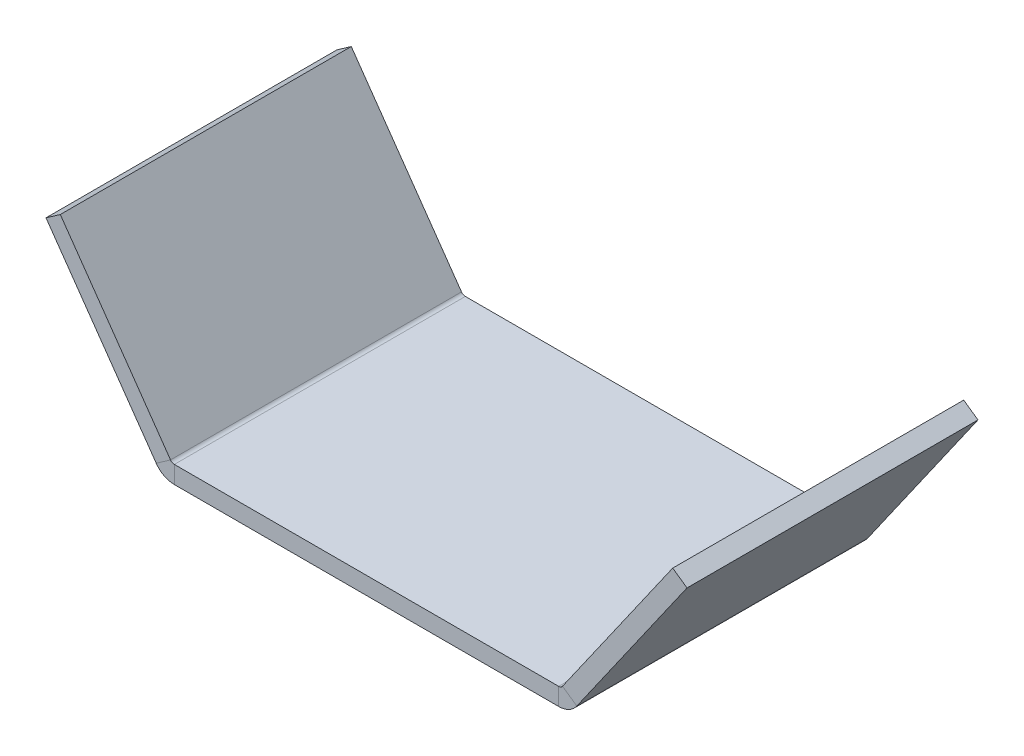
ISO-10303-21;
HEADER;
FILE_DESCRIPTION(('STEP AP214'),'2;1');
FILE_NAME('part.step','',(''),(''),'','','');
FILE_SCHEMA(('AUTOMOTIVE_DESIGN { 1 0 10303 214 1 1 1 1 }'));
ENDSEC;
DATA;
#1=APPLICATION_CONTEXT('core data for automotive mechanical design processes');
#2=APPLICATION_PROTOCOL_DEFINITION('international standard','automotive_design',2000,#1);
#3=PRODUCT_CONTEXT('',#1,'mechanical');
#4=PRODUCT('Part','Part','',(#3));
#5=PRODUCT_RELATED_PRODUCT_CATEGORY('part','',(#4));
#6=PRODUCT_DEFINITION_FORMATION('','',#4);
#7=PRODUCT_DEFINITION_CONTEXT('part definition',#1,'design');
#8=PRODUCT_DEFINITION('design','',#6,#7);
#9=PRODUCT_DEFINITION_SHAPE('','',#8);
#10=(LENGTH_UNIT() NAMED_UNIT(*) SI_UNIT(.MILLI.,.METRE.));
#11=(NAMED_UNIT(*) PLANE_ANGLE_UNIT() SI_UNIT($,.RADIAN.));
#12=(NAMED_UNIT(*) SI_UNIT($,.STERADIAN.) SOLID_ANGLE_UNIT());
#13=UNCERTAINTY_MEASURE_WITH_UNIT(LENGTH_MEASURE(1.E-05),#10,'distance_accuracy_value','');
#14=(GEOMETRIC_REPRESENTATION_CONTEXT(3) GLOBAL_UNCERTAINTY_ASSIGNED_CONTEXT((#13)) GLOBAL_UNIT_ASSIGNED_CONTEXT((#10,
#11,#12)) REPRESENTATION_CONTEXT('',''));
#15=CARTESIAN_POINT('',(0.,0.,0.));
#16=DIRECTION('',(0.,0.,1.));
#17=DIRECTION('',(1.,0.,0.));
#18=AXIS2_PLACEMENT_3D('',#15,#16,#17);
#19=CARTESIAN_POINT('',(68.0218452079034,0.,20.));
#20=DIRECTION('',(0.,0.,1.));
#21=DIRECTION('',(1.,0.,0.));
#22=AXIS2_PLACEMENT_3D('',#19,#20,#21);
#23=PLANE('',#22);
#24=DIRECTION('',(0.,1.,0.));
#25=VECTOR('',#24,1.);
#26=CARTESIAN_POINT('',(68.0218452079034,0.,20.));
#27=LINE('',#26,#25);
#28=CARTESIAN_POINT('',(68.0218452079034,0.,20.));
#29=VERTEX_POINT('',#28);
#30=CARTESIAN_POINT('',(68.0218452079034,3.,20.));
#31=VERTEX_POINT('',#30);
#32=EDGE_CURVE('E11',#29,#31,#27,.T.);
#33=ORIENTED_EDGE('',*,*,#32,.F.);
#34=CARTESIAN_POINT('',(68.0218452079034,3.8,20.));
#35=DIRECTION('',(0.,0.,1.));
#36=DIRECTION('',(1.,0.,0.));
#37=AXIS2_PLACEMENT_3D('',#34,#35,#36);
#38=CIRCLE('',#37,3.8);
#39=CARTESIAN_POINT('',(71.1346229762015,1.62040954186605,20.));
#40=VERTEX_POINT('',#39);
#41=EDGE_CURVE('E197',#40,#29,#38,.F.);
#42=ORIENTED_EDGE('',*,*,#41,.F.);
#43=DIRECTION('',(0.819152044288993,-0.573576436351044,0.));
#44=VECTOR('',#43,1.);
#45=CARTESIAN_POINT('',(68.6771668433346,3.34113885091917,20.));
#46=LINE('',#45,#44);
#47=CARTESIAN_POINT('',(68.6771668433346,3.34113885091917,20.));
#48=VERTEX_POINT('',#47);
#49=EDGE_CURVE('E50',#48,#40,#46,.T.);
#50=ORIENTED_EDGE('',*,*,#49,.F.);
#51=CARTESIAN_POINT('',(68.0218452079034,3.8,20.));
#52=DIRECTION('',(0.,0.,1.));
#53=DIRECTION('',(1.,0.,0.));
#54=AXIS2_PLACEMENT_3D('',#51,#52,#53);
#55=CIRCLE('',#54,0.8);
#56=EDGE_CURVE('E209',#48,#31,#55,.F.);
#57=ORIENTED_EDGE('',*,*,#56,.T.);
#58=EDGE_LOOP('',(#33,#42,#50,#57));
#59=FACE_BOUND('',#58,.T.);
#60=ADVANCED_FACE('F43',(#59),#23,.T.);
#61=CARTESIAN_POINT('',(68.6771668433346,3.34113885091917,20.));
#62=DIRECTION('',(0.,0.,1.));
#63=DIRECTION('',(1.,0.,0.));
#64=AXIS2_PLACEMENT_3D('',#61,#62,#63);
#65=PLANE('',#64);
#66=DIRECTION('',(-1.,0.,0.));
#67=VECTOR('',#66,1.);
#68=CARTESIAN_POINT('',(0.,0.,20.));
#69=LINE('',#68,#67);
#70=CARTESIAN_POINT('',(1.97815479209662,0.,20.));
#71=VERTEX_POINT('',#70);
#72=EDGE_CURVE('E194',#29,#71,#69,.T.);
#73=ORIENTED_EDGE('',*,*,#72,.F.);
#74=ORIENTED_EDGE('',*,*,#32,.T.);
#75=DIRECTION('',(1.,0.,0.));
#76=VECTOR('',#75,1.);
#77=CARTESIAN_POINT('',(0.,3.,20.));
#78=LINE('',#77,#76);
#79=CARTESIAN_POINT('',(1.97815479209662,3.,20.));
#80=VERTEX_POINT('',#79);
#81=EDGE_CURVE('E212',#31,#80,#78,.F.);
#82=ORIENTED_EDGE('',*,*,#81,.T.);
#83=DIRECTION('',(0.,-1.,0.));
#84=VECTOR('',#83,1.);
#85=CARTESIAN_POINT('',(1.97815479209662,3.,20.));
#86=LINE('',#85,#84);
#87=EDGE_CURVE('E64',#80,#71,#86,.T.);
#88=ORIENTED_EDGE('',*,*,#87,.T.);
#89=EDGE_LOOP('',(#73,#74,#82,#88));
#90=FACE_BOUND('',#89,.T.);
#91=ADVANCED_FACE('F288',(#90),#65,.T.);
#92=CARTESIAN_POINT('',(71.1346229762015,1.62040954186605,-30.));
#93=DIRECTION('',(0.,0.,-1.));
#94=DIRECTION('',(-1.,0.,0.));
#95=AXIS2_PLACEMENT_3D('',#92,#93,#94);
#96=PLANE('',#95);
#97=DIRECTION('',(-0.819152044288993,0.573576436351044,0.));
#98=VECTOR('',#97,1.);
#99=CARTESIAN_POINT('',(71.1346229762015,1.62040954186605,-30.));
#100=LINE('',#99,#98);
#101=CARTESIAN_POINT('',(71.1346229762015,1.62040954186605,-30.));
#102=VERTEX_POINT('',#101);
#103=CARTESIAN_POINT('',(68.6771668433346,3.34113885091917,-30.));
#104=VERTEX_POINT('',#103);
#105=EDGE_CURVE('E250',#102,#104,#100,.T.);
#106=ORIENTED_EDGE('',*,*,#105,.F.);
#107=CARTESIAN_POINT('',(68.0218452079034,3.8,-30.));
#108=DIRECTION('',(0.,0.,1.));
#109=DIRECTION('',(1.,0.,0.));
#110=AXIS2_PLACEMENT_3D('',#107,#108,#109);
#111=CIRCLE('',#110,3.8);
#112=CARTESIAN_POINT('',(68.0218452079034,0.,-30.));
#113=VERTEX_POINT('',#112);
#114=EDGE_CURVE('E165',#102,#113,#111,.F.);
#115=ORIENTED_EDGE('',*,*,#114,.T.);
#116=DIRECTION('',(0.,-1.,0.));
#117=VECTOR('',#116,1.);
#118=CARTESIAN_POINT('',(68.0218452079034,3.,-30.));
#119=LINE('',#118,#117);
#120=CARTESIAN_POINT('',(68.0218452079034,3.,-30.));
#121=VERTEX_POINT('',#120);
#122=EDGE_CURVE('E248',#121,#113,#119,.T.);
#123=ORIENTED_EDGE('',*,*,#122,.F.);
#124=CARTESIAN_POINT('',(68.0218452079034,3.8,-30.));
#125=DIRECTION('',(0.,0.,1.));
#126=DIRECTION('',(1.,0.,0.));
#127=AXIS2_PLACEMENT_3D('',#124,#125,#126);
#128=CIRCLE('',#127,0.8);
#129=EDGE_CURVE('E177',#104,#121,#128,.F.);
#130=ORIENTED_EDGE('',*,*,#129,.F.);
#131=EDGE_LOOP('',(#106,#115,#123,#130));
#132=FACE_BOUND('',#131,.T.);
#133=ADVANCED_FACE('F294',(#132),#96,.T.);
#134=CARTESIAN_POINT('',(68.0218452079034,3.,-30.));
#135=DIRECTION('',(0.,0.,-1.));
#136=DIRECTION('',(-1.,0.,0.));
#137=AXIS2_PLACEMENT_3D('',#134,#135,#136);
#138=PLANE('',#137);
#139=DIRECTION('',(-0.573576436351043,-0.819152044288994,0.));
#140=VECTOR('',#139,1.);
#141=CARTESIAN_POINT('',(70.,0.,-30.));
#142=LINE('',#141,#140);
#143=CARTESIAN_POINT('',(90.0751752722865,28.6703215501148,-30.));
#144=VERTEX_POINT('',#143);
#145=EDGE_CURVE('E168',#144,#102,#142,.T.);
#146=ORIENTED_EDGE('',*,*,#145,.T.);
#147=ORIENTED_EDGE('',*,*,#105,.T.);
#148=DIRECTION('',(-0.573576436351043,-0.819152044288994,0.));
#149=VECTOR('',#148,1.);
#150=CARTESIAN_POINT('',(67.542543867133,1.72072930905313,-30.));
#151=LINE('',#150,#149);
#152=CARTESIAN_POINT('',(87.6177191394195,30.3910508591679,-30.));
#153=VERTEX_POINT('',#152);
#154=EDGE_CURVE('E174',#153,#104,#151,.T.);
#155=ORIENTED_EDGE('',*,*,#154,.F.);
#156=DIRECTION('',(0.819152044288993,-0.573576436351044,0.));
#157=VECTOR('',#156,1.);
#158=CARTESIAN_POINT('',(87.6177191394195,30.3910508591679,-30.));
#159=LINE('',#158,#157);
#160=EDGE_CURVE('E171',#153,#144,#159,.T.);
#161=ORIENTED_EDGE('',*,*,#160,.T.);
#162=EDGE_LOOP('',(#146,#147,#155,#161));
#163=FACE_BOUND('',#162,.T.);
#164=ADVANCED_FACE('F272',(#163),#138,.T.);
#165=CARTESIAN_POINT('',(-1.13462297620153,1.62040954186601,20.));
#166=DIRECTION('',(0.,0.,1.));
#167=DIRECTION('',(1.,0.,0.));
#168=AXIS2_PLACEMENT_3D('',#165,#166,#167);
#169=PLANE('',#168);
#170=DIRECTION('',(0.819152044288989,0.57357643635105,0.));
#171=VECTOR('',#170,1.);
#172=CARTESIAN_POINT('',(-1.13462297620153,1.62040954186601,20.));
#173=LINE('',#172,#171);
#174=CARTESIAN_POINT('',(-1.13462297620153,1.62040954186601,20.));
#175=VERTEX_POINT('',#174);
#176=CARTESIAN_POINT('',(1.32283315666543,3.34113885091916,20.));
#177=VERTEX_POINT('',#176);
#178=EDGE_CURVE('E57',#175,#177,#173,.T.);
#179=ORIENTED_EDGE('',*,*,#178,.F.);
#180=CARTESIAN_POINT('',(1.97815479209662,3.8,20.));
#181=DIRECTION('',(0.,0.,1.));
#182=DIRECTION('',(1.,0.,0.));
#183=AXIS2_PLACEMENT_3D('',#180,#181,#182);
#184=CIRCLE('',#183,3.8);
#185=EDGE_CURVE('E191',#71,#175,#184,.F.);
#186=ORIENTED_EDGE('',*,*,#185,.F.);
#187=ORIENTED_EDGE('',*,*,#87,.F.);
#188=CARTESIAN_POINT('',(1.97815479209662,3.8,20.));
#189=DIRECTION('',(0.,0.,1.));
#190=DIRECTION('',(1.,0.,0.));
#191=AXIS2_PLACEMENT_3D('',#188,#189,#190);
#192=CIRCLE('',#191,0.8);
#193=EDGE_CURVE('E214',#80,#177,#192,.F.);
#194=ORIENTED_EDGE('',*,*,#193,.T.);
#195=EDGE_LOOP('',(#179,#186,#187,#194));
#196=FACE_BOUND('',#195,.T.);
#197=ADVANCED_FACE('F303',(#196),#169,.T.);
#198=CARTESIAN_POINT('',(1.97815479209662,3.,20.));
#199=DIRECTION('',(0.,0.,1.));
#200=DIRECTION('',(1.,0.,0.));
#201=AXIS2_PLACEMENT_3D('',#198,#199,#200);
#202=PLANE('',#201);
#203=DIRECTION('',(-0.57357643635105,0.819152044288989,0.));
#204=VECTOR('',#203,1.);
#205=CARTESIAN_POINT('',(0.,0.,20.));
#206=LINE('',#205,#204);
#207=CARTESIAN_POINT('',(-20.0751752722868,28.6703215501146,20.));
#208=VERTEX_POINT('',#207);
#209=EDGE_CURVE('E188',#175,#208,#206,.T.);
#210=ORIENTED_EDGE('',*,*,#209,.F.);
#211=ORIENTED_EDGE('',*,*,#178,.T.);
#212=DIRECTION('',(-0.57357643635105,0.819152044288989,0.));
#213=VECTOR('',#212,1.);
#214=CARTESIAN_POINT('',(2.45745613286697,1.72072930905315,20.));
#215=LINE('',#214,#213);
#216=CARTESIAN_POINT('',(-17.6177191394198,30.3910508591678,20.));
#217=VERTEX_POINT('',#216);
#218=EDGE_CURVE('E185',#177,#217,#215,.T.);
#219=ORIENTED_EDGE('',*,*,#218,.T.);
#220=DIRECTION('',(0.819152044288989,0.573576436351049,0.));
#221=VECTOR('',#220,1.);
#222=CARTESIAN_POINT('',(-20.0751752722868,28.6703215501146,20.));
#223=LINE('',#222,#221);
#224=EDGE_CURVE('E136',#208,#217,#223,.T.);
#225=ORIENTED_EDGE('',*,*,#224,.F.);
#226=EDGE_LOOP('',(#210,#211,#219,#225));
#227=FACE_BOUND('',#226,.T.);
#228=ADVANCED_FACE('F308',(#227),#202,.T.);
#229=CARTESIAN_POINT('',(1.97815479209662,0.,-30.));
#230=DIRECTION('',(0.,0.,-1.));
#231=DIRECTION('',(-1.,0.,0.));
#232=AXIS2_PLACEMENT_3D('',#229,#230,#231);
#233=PLANE('',#232);
#234=DIRECTION('',(0.,1.,0.));
#235=VECTOR('',#234,1.);
#236=CARTESIAN_POINT('',(1.97815479209662,0.,-30.));
#237=LINE('',#236,#235);
#238=CARTESIAN_POINT('',(1.97815479209662,0.,-30.));
#239=VERTEX_POINT('',#238);
#240=CARTESIAN_POINT('',(1.97815479209662,3.,-30.));
#241=VERTEX_POINT('',#240);
#242=EDGE_CURVE('E244',#239,#241,#237,.T.);
#243=ORIENTED_EDGE('',*,*,#242,.F.);
#244=CARTESIAN_POINT('',(1.97815479209662,3.8,-30.));
#245=DIRECTION('',(0.,0.,1.));
#246=DIRECTION('',(1.,0.,0.));
#247=AXIS2_PLACEMENT_3D('',#244,#245,#246);
#248=CIRCLE('',#247,3.8);
#249=CARTESIAN_POINT('',(-1.13462297620153,1.62040954186601,-30.));
#250=VERTEX_POINT('',#249);
#251=EDGE_CURVE('E159',#239,#250,#248,.F.);
#252=ORIENTED_EDGE('',*,*,#251,.T.);
#253=DIRECTION('',(-0.819152044288989,-0.57357643635105,0.));
#254=VECTOR('',#253,1.);
#255=CARTESIAN_POINT('',(1.32283315666543,3.34113885091916,-30.));
#256=LINE('',#255,#254);
#257=CARTESIAN_POINT('',(1.32283315666543,3.34113885091916,-30.));
#258=VERTEX_POINT('',#257);
#259=EDGE_CURVE('E140',#258,#250,#256,.T.);
#260=ORIENTED_EDGE('',*,*,#259,.F.);
#261=CARTESIAN_POINT('',(1.97815479209662,3.8,-30.));
#262=DIRECTION('',(0.,0.,1.));
#263=DIRECTION('',(1.,0.,0.));
#264=AXIS2_PLACEMENT_3D('',#261,#262,#263);
#265=CIRCLE('',#264,0.8);
#266=EDGE_CURVE('E183',#241,#258,#265,.F.);
#267=ORIENTED_EDGE('',*,*,#266,.F.);
#268=EDGE_LOOP('',(#243,#252,#260,#267));
#269=FACE_BOUND('',#268,.T.);
#270=ADVANCED_FACE('F300',(#269),#233,.T.);
#271=CARTESIAN_POINT('',(1.32283315666543,3.34113885091916,-30.));
#272=DIRECTION('',(0.,0.,-1.));
#273=DIRECTION('',(-1.,0.,0.));
#274=AXIS2_PLACEMENT_3D('',#271,#272,#273);
#275=PLANE('',#274);
#276=DIRECTION('',(-1.,0.,0.));
#277=VECTOR('',#276,1.);
#278=CARTESIAN_POINT('',(0.,0.,-30.));
#279=LINE('',#278,#277);
#280=EDGE_CURVE('E162',#113,#239,#279,.T.);
#281=ORIENTED_EDGE('',*,*,#280,.T.);
#282=ORIENTED_EDGE('',*,*,#242,.T.);
#283=DIRECTION('',(1.,0.,0.));
#284=VECTOR('',#283,1.);
#285=CARTESIAN_POINT('',(0.,3.,-30.));
#286=LINE('',#285,#284);
#287=EDGE_CURVE('E180',#121,#241,#286,.F.);
#288=ORIENTED_EDGE('',*,*,#287,.F.);
#289=ORIENTED_EDGE('',*,*,#122,.T.);
#290=EDGE_LOOP('',(#281,#282,#288,#289));
#291=FACE_BOUND('',#290,.T.);
#292=ADVANCED_FACE('F296',(#291),#275,.T.);
#293=CARTESIAN_POINT('',(2.45745613286697,1.72072930905315,20.));
#294=DIRECTION('',(-0.819152044288989,-0.57357643635105,0.));
#295=DIRECTION('',(0.57357643635105,-0.819152044288989,0.));
#296=AXIS2_PLACEMENT_3D('',#293,#294,#295);
#297=PLANE('',#296);
#298=DIRECTION('',(0.,0.,-1.));
#299=VECTOR('',#298,1.);
#300=CARTESIAN_POINT('',(1.32283315666543,3.34113885091916,20.));
#301=LINE('',#300,#299);
#302=EDGE_CURVE('E155',#177,#258,#301,.T.);
#303=ORIENTED_EDGE('',*,*,#302,.T.);
#304=DIRECTION('',(-0.57357643635105,0.819152044288989,0.));
#305=VECTOR('',#304,1.);
#306=CARTESIAN_POINT('',(2.45745613286697,1.72072930905315,-30.));
#307=LINE('',#306,#305);
#308=CARTESIAN_POINT('',(-17.6177191394198,30.3910508591678,-30.));
#309=VERTEX_POINT('',#308);
#310=EDGE_CURVE('E147',#258,#309,#307,.T.);
#311=ORIENTED_EDGE('',*,*,#310,.T.);
#312=DIRECTION('',(0.,0.,-1.));
#313=VECTOR('',#312,1.);
#314=CARTESIAN_POINT('',(-17.6177191394198,30.3910508591678,20.));
#315=LINE('',#314,#313);
#316=EDGE_CURVE('E131',#217,#309,#315,.T.);
#317=ORIENTED_EDGE('',*,*,#316,.F.);
#318=ORIENTED_EDGE('',*,*,#218,.F.);
#319=EDGE_LOOP('',(#303,#311,#317,#318));
#320=FACE_BOUND('',#319,.T.);
#321=ADVANCED_FACE('F153',(#320),#297,.F.);
#322=CARTESIAN_POINT('',(-20.0751752722868,28.6703215501146,20.));
#323=DIRECTION('',(-0.573576436351049,0.819152044288989,0.));
#324=DIRECTION('',(-0.81915204428899,-0.57357643635105,0.));
#325=AXIS2_PLACEMENT_3D('',#322,#323,#324);
#326=PLANE('',#325);
#327=ORIENTED_EDGE('',*,*,#316,.T.);
#328=DIRECTION('',(0.819152044288989,0.573576436351049,0.));
#329=VECTOR('',#328,1.);
#330=CARTESIAN_POINT('',(-20.0751752722868,28.6703215501146,-30.));
#331=LINE('',#330,#329);
#332=CARTESIAN_POINT('',(-20.0751752722868,28.6703215501146,-30.));
#333=VERTEX_POINT('',#332);
#334=EDGE_CURVE('E134',#333,#309,#331,.T.);
#335=ORIENTED_EDGE('',*,*,#334,.F.);
#336=DIRECTION('',(0.,0.,-1.));
#337=VECTOR('',#336,1.);
#338=CARTESIAN_POINT('',(-20.0751752722868,28.6703215501146,20.));
#339=LINE('',#338,#337);
#340=EDGE_CURVE('E141',#208,#333,#339,.T.);
#341=ORIENTED_EDGE('',*,*,#340,.F.);
#342=ORIENTED_EDGE('',*,*,#224,.T.);
#343=EDGE_LOOP('',(#327,#335,#341,#342));
#344=FACE_BOUND('',#343,.T.);
#345=ADVANCED_FACE('F133',(#344),#326,.T.);
#346=CARTESIAN_POINT('',(0.,0.,20.));
#347=DIRECTION('',(-0.819152044288989,-0.57357643635105,0.));
#348=DIRECTION('',(0.57357643635105,-0.819152044288989,0.));
#349=AXIS2_PLACEMENT_3D('',#346,#347,#348);
#350=PLANE('',#349);
#351=ORIENTED_EDGE('',*,*,#340,.T.);
#352=DIRECTION('',(-0.57357643635105,0.819152044288989,0.));
#353=VECTOR('',#352,1.);
#354=CARTESIAN_POINT('',(0.,0.,-30.));
#355=LINE('',#354,#353);
#356=EDGE_CURVE('E150',#250,#333,#355,.T.);
#357=ORIENTED_EDGE('',*,*,#356,.F.);
#358=DIRECTION('',(0.,0.,-1.));
#359=VECTOR('',#358,1.);
#360=CARTESIAN_POINT('',(-1.13462297620153,1.62040954186601,20.));
#361=LINE('',#360,#359);
#362=EDGE_CURVE('E239',#175,#250,#361,.T.);
#363=ORIENTED_EDGE('',*,*,#362,.F.);
#364=ORIENTED_EDGE('',*,*,#209,.T.);
#365=EDGE_LOOP('',(#351,#357,#363,#364));
#366=FACE_BOUND('',#365,.T.);
#367=ADVANCED_FACE('F306',(#366),#350,.T.);
#368=CARTESIAN_POINT('',(1.97815479209662,3.8,20.));
#369=DIRECTION('',(0.,0.,-1.));
#370=DIRECTION('',(-1.,0.,0.));
#371=AXIS2_PLACEMENT_3D('',#368,#369,#370);
#372=CYLINDRICAL_SURFACE('',#371,3.8);
#373=ORIENTED_EDGE('',*,*,#362,.T.);
#374=ORIENTED_EDGE('',*,*,#251,.F.);
#375=DIRECTION('',(0.,0.,-1.));
#376=VECTOR('',#375,1.);
#377=CARTESIAN_POINT('',(1.97815479209662,0.,20.));
#378=LINE('',#377,#376);
#379=EDGE_CURVE('E236',#71,#239,#378,.T.);
#380=ORIENTED_EDGE('',*,*,#379,.F.);
#381=ORIENTED_EDGE('',*,*,#185,.T.);
#382=EDGE_LOOP('',(#373,#374,#380,#381));
#383=FACE_BOUND('',#382,.T.);
#384=ADVANCED_FACE('F309',(#383),#372,.T.);
#385=CARTESIAN_POINT('',(0.,0.,20.));
#386=DIRECTION('',(0.,-1.,0.));
#387=DIRECTION('',(0.,0.,-1.));
#388=AXIS2_PLACEMENT_3D('',#385,#386,#387);
#389=PLANE('',#388);
#390=ORIENTED_EDGE('',*,*,#379,.T.);
#391=ORIENTED_EDGE('',*,*,#280,.F.);
#392=DIRECTION('',(0.,0.,-1.));
#393=VECTOR('',#392,1.);
#394=CARTESIAN_POINT('',(68.0218452079034,0.,20.));
#395=LINE('',#394,#393);
#396=EDGE_CURVE('E233',#29,#113,#395,.T.);
#397=ORIENTED_EDGE('',*,*,#396,.F.);
#398=ORIENTED_EDGE('',*,*,#72,.T.);
#399=EDGE_LOOP('',(#390,#391,#397,#398));
#400=FACE_BOUND('',#399,.T.);
#401=ADVANCED_FACE('F291',(#400),#389,.T.);
#402=CARTESIAN_POINT('',(68.0218452079034,3.8,20.));
#403=DIRECTION('',(0.,0.,-1.));
#404=DIRECTION('',(-1.,0.,0.));
#405=AXIS2_PLACEMENT_3D('',#402,#403,#404);
#406=CYLINDRICAL_SURFACE('',#405,3.8);
#407=ORIENTED_EDGE('',*,*,#396,.T.);
#408=ORIENTED_EDGE('',*,*,#114,.F.);
#409=DIRECTION('',(0.,0.,-1.));
#410=VECTOR('',#409,1.);
#411=CARTESIAN_POINT('',(71.1346229762015,1.62040954186605,20.));
#412=LINE('',#411,#410);
#413=EDGE_CURVE('E230',#40,#102,#412,.T.);
#414=ORIENTED_EDGE('',*,*,#413,.F.);
#415=ORIENTED_EDGE('',*,*,#41,.T.);
#416=EDGE_LOOP('',(#407,#408,#414,#415));
#417=FACE_BOUND('',#416,.T.);
#418=ADVANCED_FACE('F262',(#417),#406,.T.);
#419=CARTESIAN_POINT('',(70.,0.,20.));
#420=DIRECTION('',(0.819152044288994,-0.573576436351043,0.));
#421=DIRECTION('',(0.573576436351043,0.819152044288994,0.));
#422=AXIS2_PLACEMENT_3D('',#419,#420,#421);
#423=PLANE('',#422);
#424=ORIENTED_EDGE('',*,*,#413,.T.);
#425=ORIENTED_EDGE('',*,*,#145,.F.);
#426=DIRECTION('',(0.,0.,-1.));
#427=VECTOR('',#426,1.);
#428=CARTESIAN_POINT('',(90.0751752722865,28.6703215501148,20.));
#429=LINE('',#428,#427);
#430=CARTESIAN_POINT('',(90.0751752722865,28.6703215501148,20.));
#431=VERTEX_POINT('',#430);
#432=EDGE_CURVE('E228',#431,#144,#429,.T.);
#433=ORIENTED_EDGE('',*,*,#432,.F.);
#434=DIRECTION('',(-0.573576436351043,-0.819152044288994,0.));
#435=VECTOR('',#434,1.);
#436=CARTESIAN_POINT('',(70.,0.,20.));
#437=LINE('',#436,#435);
#438=EDGE_CURVE('E200',#431,#40,#437,.T.);
#439=ORIENTED_EDGE('',*,*,#438,.T.);
#440=EDGE_LOOP('',(#424,#425,#433,#439));
#441=FACE_BOUND('',#440,.T.);
#442=ADVANCED_FACE('F266',(#441),#423,.T.);
#443=CARTESIAN_POINT('',(87.6177191394195,30.3910508591679,20.));
#444=DIRECTION('',(0.573576436351044,0.819152044288993,0.));
#445=DIRECTION('',(-0.819152044288993,0.573576436351044,0.));
#446=AXIS2_PLACEMENT_3D('',#443,#444,#445);
#447=PLANE('',#446);
#448=ORIENTED_EDGE('',*,*,#432,.T.);
#449=ORIENTED_EDGE('',*,*,#160,.F.);
#450=DIRECTION('',(0.,0.,-1.));
#451=VECTOR('',#450,1.);
#452=CARTESIAN_POINT('',(87.6177191394195,30.3910508591679,20.));
#453=LINE('',#452,#451);
#454=CARTESIAN_POINT('',(87.6177191394195,30.3910508591679,20.));
#455=VERTEX_POINT('',#454);
#456=EDGE_CURVE('E226',#455,#153,#453,.T.);
#457=ORIENTED_EDGE('',*,*,#456,.F.);
#458=DIRECTION('',(0.819152044288993,-0.573576436351044,0.));
#459=VECTOR('',#458,1.);
#460=CARTESIAN_POINT('',(87.6177191394195,30.3910508591679,20.));
#461=LINE('',#460,#459);
#462=EDGE_CURVE('E203',#455,#431,#461,.T.);
#463=ORIENTED_EDGE('',*,*,#462,.T.);
#464=EDGE_LOOP('',(#448,#449,#457,#463));
#465=FACE_BOUND('',#464,.T.);
#466=ADVANCED_FACE('F269',(#465),#447,.T.);
#467=CARTESIAN_POINT('',(67.542543867133,1.72072930905313,20.));
#468=DIRECTION('',(0.819152044288994,-0.573576436351043,0.));
#469=DIRECTION('',(0.573576436351043,0.819152044288994,0.));
#470=AXIS2_PLACEMENT_3D('',#467,#468,#469);
#471=PLANE('',#470);
#472=ORIENTED_EDGE('',*,*,#456,.T.);
#473=ORIENTED_EDGE('',*,*,#154,.T.);
#474=DIRECTION('',(0.,0.,-1.));
#475=VECTOR('',#474,1.);
#476=CARTESIAN_POINT('',(68.6771668433346,3.34113885091917,20.));
#477=LINE('',#476,#475);
#478=EDGE_CURVE('E223',#48,#104,#477,.T.);
#479=ORIENTED_EDGE('',*,*,#478,.F.);
#480=DIRECTION('',(-0.573576436351043,-0.819152044288994,0.));
#481=VECTOR('',#480,1.);
#482=CARTESIAN_POINT('',(67.542543867133,1.72072930905313,20.));
#483=LINE('',#482,#481);
#484=EDGE_CURVE('E206',#455,#48,#483,.T.);
#485=ORIENTED_EDGE('',*,*,#484,.F.);
#486=EDGE_LOOP('',(#472,#473,#479,#485));
#487=FACE_BOUND('',#486,.T.);
#488=ADVANCED_FACE('F274',(#487),#471,.F.);
#489=CARTESIAN_POINT('',(68.0218452079034,3.8,20.));
#490=DIRECTION('',(0.,0.,-1.));
#491=DIRECTION('',(-1.,0.,0.));
#492=AXIS2_PLACEMENT_3D('',#489,#490,#491);
#493=CYLINDRICAL_SURFACE('',#492,0.8);
#494=ORIENTED_EDGE('',*,*,#478,.T.);
#495=ORIENTED_EDGE('',*,*,#129,.T.);
#496=DIRECTION('',(0.,0.,-1.));
#497=VECTOR('',#496,1.);
#498=CARTESIAN_POINT('',(68.0218452079034,3.,20.));
#499=LINE('',#498,#497);
#500=EDGE_CURVE('E220',#31,#121,#499,.T.);
#501=ORIENTED_EDGE('',*,*,#500,.F.);
#502=ORIENTED_EDGE('',*,*,#56,.F.);
#503=EDGE_LOOP('',(#494,#495,#501,#502));
#504=FACE_BOUND('',#503,.T.);
#505=ADVANCED_FACE('F279',(#504),#493,.F.);
#506=CARTESIAN_POINT('',(0.,3.,20.));
#507=DIRECTION('',(0.,-1.,0.));
#508=DIRECTION('',(0.,0.,-1.));
#509=AXIS2_PLACEMENT_3D('',#506,#507,#508);
#510=PLANE('',#509);
#511=ORIENTED_EDGE('',*,*,#500,.T.);
#512=ORIENTED_EDGE('',*,*,#287,.T.);
#513=DIRECTION('',(0.,0.,-1.));
#514=VECTOR('',#513,1.);
#515=CARTESIAN_POINT('',(1.97815479209662,3.,20.));
#516=LINE('',#515,#514);
#517=EDGE_CURVE('E217',#80,#241,#516,.T.);
#518=ORIENTED_EDGE('',*,*,#517,.F.);
#519=ORIENTED_EDGE('',*,*,#81,.F.);
#520=EDGE_LOOP('',(#511,#512,#518,#519));
#521=FACE_BOUND('',#520,.T.);
#522=ADVANCED_FACE('F284',(#521),#510,.F.);
#523=CARTESIAN_POINT('',(1.97815479209662,3.8,20.));
#524=DIRECTION('',(0.,0.,-1.));
#525=DIRECTION('',(-1.,0.,0.));
#526=AXIS2_PLACEMENT_3D('',#523,#524,#525);
#527=CYLINDRICAL_SURFACE('',#526,0.8);
#528=ORIENTED_EDGE('',*,*,#517,.T.);
#529=ORIENTED_EDGE('',*,*,#266,.T.);
#530=ORIENTED_EDGE('',*,*,#302,.F.);
#531=ORIENTED_EDGE('',*,*,#193,.F.);
#532=EDGE_LOOP('',(#528,#529,#530,#531));
#533=FACE_BOUND('',#532,.T.);
#534=ADVANCED_FACE('F302',(#533),#527,.F.);
#535=CARTESIAN_POINT('',(1.97815479209662,3.8,20.));
#536=DIRECTION('',(0.,0.,1.));
#537=DIRECTION('',(1.,0.,0.));
#538=AXIS2_PLACEMENT_3D('',#535,#536,#537);
#539=PLANE('',#538);
#540=ORIENTED_EDGE('',*,*,#484,.T.);
#541=ORIENTED_EDGE('',*,*,#49,.T.);
#542=ORIENTED_EDGE('',*,*,#438,.F.);
#543=ORIENTED_EDGE('',*,*,#462,.F.);
#544=EDGE_LOOP('',(#540,#541,#542,#543));
#545=FACE_BOUND('',#544,.T.);
#546=ADVANCED_FACE('F254',(#545),#539,.T.);
#547=CARTESIAN_POINT('',(1.97815479209662,3.8,-30.));
#548=DIRECTION('',(0.,0.,1.));
#549=DIRECTION('',(1.,0.,0.));
#550=AXIS2_PLACEMENT_3D('',#547,#548,#549);
#551=PLANE('',#550);
#552=ORIENTED_EDGE('',*,*,#310,.F.);
#553=ORIENTED_EDGE('',*,*,#259,.T.);
#554=ORIENTED_EDGE('',*,*,#356,.T.);
#555=ORIENTED_EDGE('',*,*,#334,.T.);
#556=EDGE_LOOP('',(#552,#553,#554,#555));
#557=FACE_BOUND('',#556,.T.);
#558=ADVANCED_FACE('F146',(#557),#551,.F.);
#559=CLOSED_SHELL('',(#60,#91,#133,#164,#197,#228,#270,#292,#321,#345,#367,#384,#401,#418,#442,
#466,#488,#505,#522,#534,#546,#558));
#560=MANIFOLD_SOLID_BREP('B2',#559);
#561=ADVANCED_BREP_SHAPE_REPRESENTATION('',(#18,#560),#14);
#562=SHAPE_DEFINITION_REPRESENTATION(#9,#561);
ENDSEC;
END-ISO-10303-21;
